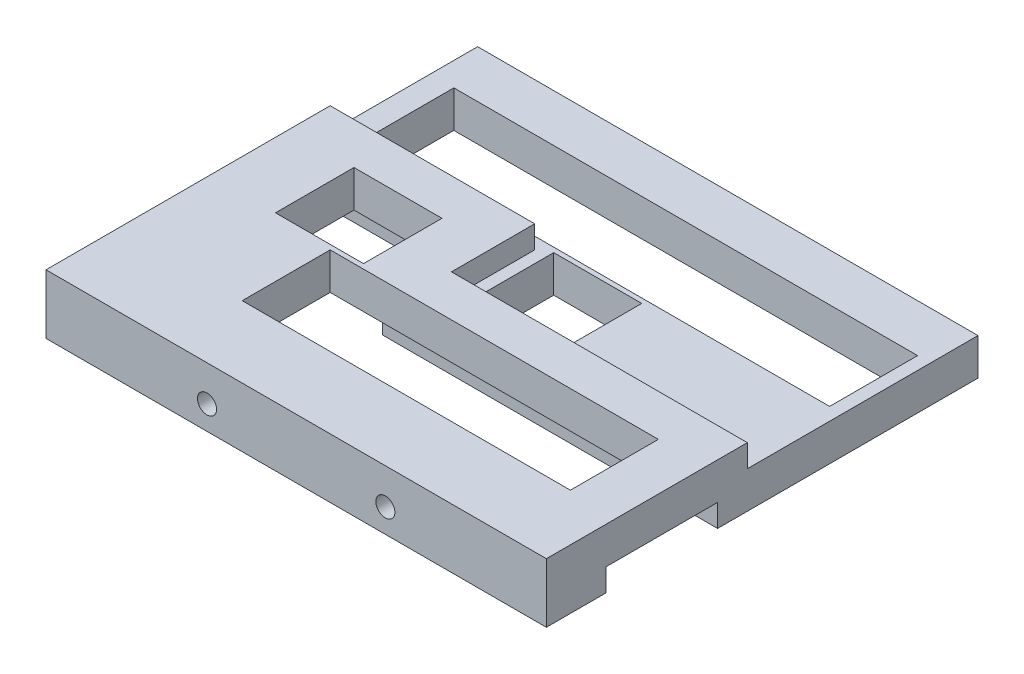
ISO-10303-21;
HEADER;
FILE_DESCRIPTION(('STEP AP214'),'2;1');
FILE_NAME('part.step','',(''),(''),'','','');
FILE_SCHEMA(('AUTOMOTIVE_DESIGN { 1 0 10303 214 1 1 1 1 }'));
ENDSEC;
DATA;
#1=APPLICATION_CONTEXT('core data for automotive mechanical design processes');
#2=APPLICATION_PROTOCOL_DEFINITION('international standard','automotive_design',2000,#1);
#3=PRODUCT_CONTEXT('',#1,'mechanical');
#4=PRODUCT('Part','Part','',(#3));
#5=PRODUCT_RELATED_PRODUCT_CATEGORY('part','',(#4));
#6=PRODUCT_DEFINITION_FORMATION('','',#4);
#7=PRODUCT_DEFINITION_CONTEXT('part definition',#1,'design');
#8=PRODUCT_DEFINITION('design','',#6,#7);
#9=PRODUCT_DEFINITION_SHAPE('','',#8);
#10=(LENGTH_UNIT() NAMED_UNIT(*) SI_UNIT(.MILLI.,.METRE.));
#11=(NAMED_UNIT(*) PLANE_ANGLE_UNIT() SI_UNIT($,.RADIAN.));
#12=(NAMED_UNIT(*) SI_UNIT($,.STERADIAN.) SOLID_ANGLE_UNIT());
#13=UNCERTAINTY_MEASURE_WITH_UNIT(LENGTH_MEASURE(1.E-05),#10,'distance_accuracy_value','');
#14=(GEOMETRIC_REPRESENTATION_CONTEXT(3) GLOBAL_UNCERTAINTY_ASSIGNED_CONTEXT((#13)) GLOBAL_UNIT_ASSIGNED_CONTEXT((#10,
#11,#12)) REPRESENTATION_CONTEXT('',''));
#15=CARTESIAN_POINT('',(0.,0.,0.));
#16=DIRECTION('',(0.,0.,1.));
#17=DIRECTION('',(1.,0.,0.));
#18=AXIS2_PLACEMENT_3D('',#15,#16,#17);
#19=CARTESIAN_POINT('',(0.,-1.2E-05,-103.));
#20=DIRECTION('',(0.,0.,-1.));
#21=DIRECTION('',(-1.,0.,0.));
#22=AXIS2_PLACEMENT_3D('',#19,#20,#21);
#23=PLANE('',#22);
#24=DIRECTION('',(-1.,0.,0.));
#25=VECTOR('',#24,1.);
#26=CARTESIAN_POINT('',(0.,9.5,-103.));
#27=LINE('',#26,#25);
#28=CARTESIAN_POINT('',(-41.4686269665969,9.5,-103.));
#29=VERTEX_POINT('',#28);
#30=CARTESIAN_POINT('',(-105.2,9.5,-103.));
#31=VERTEX_POINT('',#30);
#32=EDGE_CURVE('E263',#29,#31,#27,.T.);
#33=ORIENTED_EDGE('',*,*,#32,.F.);
#34=CARTESIAN_POINT('',(-37.5,10.,-103.));
#35=DIRECTION('',(0.,0.,-1.));
#36=DIRECTION('',(-1.,0.,0.));
#37=AXIS2_PLACEMENT_3D('',#34,#35,#36);
#38=CIRCLE('',#37,3.99999999999999);
#39=CARTESIAN_POINT('',(-33.5313730334031,9.5,-103.));
#40=VERTEX_POINT('',#39);
#41=EDGE_CURVE('E60',#29,#40,#38,.F.);
#42=ORIENTED_EDGE('',*,*,#41,.T.);
#43=CARTESIAN_POINT('',(33.5313730334031,9.5,-103.));
#44=VERTEX_POINT('',#43);
#45=EDGE_CURVE('E262',#44,#40,#27,.T.);
#46=ORIENTED_EDGE('',*,*,#45,.F.);
#47=CARTESIAN_POINT('',(37.5,10.,-103.));
#48=DIRECTION('',(0.,0.,-1.));
#49=DIRECTION('',(-1.,0.,0.));
#50=AXIS2_PLACEMENT_3D('',#47,#48,#49);
#51=CIRCLE('',#50,3.99999999999999);
#52=CARTESIAN_POINT('',(41.4686269665969,9.5,-103.));
#53=VERTEX_POINT('',#52);
#54=EDGE_CURVE('E67',#44,#53,#51,.F.);
#55=ORIENTED_EDGE('',*,*,#54,.T.);
#56=CARTESIAN_POINT('',(105.2,9.5,-103.));
#57=VERTEX_POINT('',#56);
#58=EDGE_CURVE('E282',#57,#53,#27,.T.);
#59=ORIENTED_EDGE('',*,*,#58,.F.);
#60=DIRECTION('',(0.,1.,0.));
#61=VECTOR('',#60,1.);
#62=CARTESIAN_POINT('',(105.2,-1.2E-05,-103.));
#63=LINE('',#62,#61);
#64=CARTESIAN_POINT('',(105.2,0.,-103.));
#65=VERTEX_POINT('',#64);
#66=EDGE_CURVE('E320',#65,#57,#63,.T.);
#67=ORIENTED_EDGE('',*,*,#66,.F.);
#68=DIRECTION('',(-1.,0.,0.));
#69=VECTOR('',#68,1.);
#70=CARTESIAN_POINT('',(0.,0.,-103.));
#71=LINE('',#70,#69);
#72=CARTESIAN_POINT('',(-105.2,0.,-103.));
#73=VERTEX_POINT('',#72);
#74=EDGE_CURVE('E11',#65,#73,#71,.T.);
#75=ORIENTED_EDGE('',*,*,#74,.T.);
#76=DIRECTION('',(0.,1.,0.));
#77=VECTOR('',#76,1.);
#78=CARTESIAN_POINT('',(-105.2,-1.2E-05,-103.));
#79=LINE('',#78,#77);
#80=EDGE_CURVE('E317',#73,#31,#79,.T.);
#81=ORIENTED_EDGE('',*,*,#80,.T.);
#82=EDGE_LOOP('',(#33,#42,#46,#55,#59,#67,#75,#81));
#83=FACE_BOUND('',#82,.T.);
#84=ADVANCED_FACE('F45',(#83),#23,.T.);
#85=CARTESIAN_POINT('',(105.2,25.,0.));
#86=DIRECTION('',(1.,0.,0.));
#87=DIRECTION('',(0.,0.,-1.));
#88=AXIS2_PLACEMENT_3D('',#85,#86,#87);
#89=PLANE('',#88);
#90=DIRECTION('',(0.,0.,1.));
#91=VECTOR('',#90,1.);
#92=CARTESIAN_POINT('',(105.2,0.,0.));
#93=LINE('',#92,#91);
#94=CARTESIAN_POINT('',(105.2,0.,-78.));
#95=VERTEX_POINT('',#94);
#96=EDGE_CURVE('E382',#65,#95,#93,.T.);
#97=ORIENTED_EDGE('',*,*,#96,.F.);
#98=ORIENTED_EDGE('',*,*,#66,.T.);
#99=DIRECTION('',(0.,0.,1.));
#100=VECTOR('',#99,1.);
#101=CARTESIAN_POINT('',(105.2,9.5,0.));
#102=LINE('',#101,#100);
#103=CARTESIAN_POINT('',(105.2,9.5,-150.));
#104=VERTEX_POINT('',#103);
#105=EDGE_CURVE('E287',#104,#57,#102,.T.);
#106=ORIENTED_EDGE('',*,*,#105,.F.);
#107=DIRECTION('',(0.,1.,0.));
#108=VECTOR('',#107,1.);
#109=CARTESIAN_POINT('',(105.2,-1.2E-05,-150.));
#110=LINE('',#109,#108);
#111=CARTESIAN_POINT('',(105.2,0.,-150.));
#112=VERTEX_POINT('',#111);
#113=EDGE_CURVE('E304',#112,#104,#110,.T.);
#114=ORIENTED_EDGE('',*,*,#113,.F.);
#115=CARTESIAN_POINT('',(105.2,0.,-259.5));
#116=VERTEX_POINT('',#115);
#117=EDGE_CURVE('E425',#116,#112,#93,.T.);
#118=ORIENTED_EDGE('',*,*,#117,.F.);
#119=DIRECTION('',(0.,-1.,0.));
#120=VECTOR('',#119,1.);
#121=CARTESIAN_POINT('',(105.2,25.,-259.5));
#122=LINE('',#121,#120);
#123=CARTESIAN_POINT('',(105.2,15.5,-259.5));
#124=VERTEX_POINT('',#123);
#125=EDGE_CURVE('E523',#124,#116,#122,.T.);
#126=ORIENTED_EDGE('',*,*,#125,.F.);
#127=DIRECTION('',(0.,0.,-1.));
#128=VECTOR('',#127,1.);
#129=CARTESIAN_POINT('',(105.2,15.5,0.));
#130=LINE('',#129,#128);
#131=CARTESIAN_POINT('',(105.2,15.5,-162.5));
#132=VERTEX_POINT('',#131);
#133=EDGE_CURVE('E356',#132,#124,#130,.T.);
#134=ORIENTED_EDGE('',*,*,#133,.F.);
#135=DIRECTION('',(0.,-1.,0.));
#136=VECTOR('',#135,1.);
#137=CARTESIAN_POINT('',(105.2,25.000012,-162.5));
#138=LINE('',#137,#136);
#139=CARTESIAN_POINT('',(105.2,25.,-162.5));
#140=VERTEX_POINT('',#139);
#141=EDGE_CURVE('E376',#140,#132,#138,.T.);
#142=ORIENTED_EDGE('',*,*,#141,.F.);
#143=DIRECTION('',(0.,0.,1.));
#144=VECTOR('',#143,1.);
#145=CARTESIAN_POINT('',(105.2,25.,0.));
#146=LINE('',#145,#144);
#147=CARTESIAN_POINT('',(105.2,25.,-78.));
#148=VERTEX_POINT('',#147);
#149=EDGE_CURVE('E383',#140,#148,#146,.T.);
#150=ORIENTED_EDGE('',*,*,#149,.T.);
#151=DIRECTION('',(0.,-1.,0.));
#152=VECTOR('',#151,1.);
#153=CARTESIAN_POINT('',(105.2,25.,-78.));
#154=LINE('',#153,#152);
#155=EDGE_CURVE('E424',#148,#95,#154,.T.);
#156=ORIENTED_EDGE('',*,*,#155,.T.);
#157=EDGE_LOOP('',(#97,#98,#106,#114,#118,#126,#134,#142,#150,#156));
#158=FACE_BOUND('',#157,.T.);
#159=ADVANCED_FACE('F47',(#158),#89,.T.);
#160=CARTESIAN_POINT('',(-105.2,25.,0.));
#161=DIRECTION('',(1.,0.,0.));
#162=DIRECTION('',(0.,0.,-1.));
#163=AXIS2_PLACEMENT_3D('',#160,#161,#162);
#164=PLANE('',#163);
#165=ORIENTED_EDGE('',*,*,#80,.F.);
#166=DIRECTION('',(0.,0.,1.));
#167=VECTOR('',#166,1.);
#168=CARTESIAN_POINT('',(-105.2,0.,0.));
#169=LINE('',#168,#167);
#170=CARTESIAN_POINT('',(-105.2,0.,-78.));
#171=VERTEX_POINT('',#170);
#172=EDGE_CURVE('E433',#73,#171,#169,.T.);
#173=ORIENTED_EDGE('',*,*,#172,.T.);
#174=DIRECTION('',(0.,-1.,0.));
#175=VECTOR('',#174,1.);
#176=CARTESIAN_POINT('',(-105.2,25.,-78.));
#177=LINE('',#176,#175);
#178=CARTESIAN_POINT('',(-105.2,25.,-78.));
#179=VERTEX_POINT('',#178);
#180=EDGE_CURVE('E534',#179,#171,#177,.T.);
#181=ORIENTED_EDGE('',*,*,#180,.F.);
#182=DIRECTION('',(0.,0.,1.));
#183=VECTOR('',#182,1.);
#184=CARTESIAN_POINT('',(-105.2,25.,0.));
#185=LINE('',#184,#183);
#186=CARTESIAN_POINT('',(-105.2,25.,-197.5));
#187=VERTEX_POINT('',#186);
#188=EDGE_CURVE('E386',#187,#179,#185,.T.);
#189=ORIENTED_EDGE('',*,*,#188,.F.);
#190=DIRECTION('',(0.,-1.,0.));
#191=VECTOR('',#190,1.);
#192=CARTESIAN_POINT('',(-105.2,25.000012,-197.5));
#193=LINE('',#192,#191);
#194=CARTESIAN_POINT('',(-105.2,15.5,-197.5));
#195=VERTEX_POINT('',#194);
#196=EDGE_CURVE('E372',#187,#195,#193,.T.);
#197=ORIENTED_EDGE('',*,*,#196,.T.);
#198=DIRECTION('',(0.,0.,1.));
#199=VECTOR('',#198,1.);
#200=CARTESIAN_POINT('',(-105.2,15.5,0.));
#201=LINE('',#200,#199);
#202=CARTESIAN_POINT('',(-105.2,15.5,-259.5));
#203=VERTEX_POINT('',#202);
#204=EDGE_CURVE('E362',#203,#195,#201,.T.);
#205=ORIENTED_EDGE('',*,*,#204,.F.);
#206=DIRECTION('',(0.,-1.,0.));
#207=VECTOR('',#206,1.);
#208=CARTESIAN_POINT('',(-105.2,25.,-259.5));
#209=LINE('',#208,#207);
#210=CARTESIAN_POINT('',(-105.2,0.,-259.5));
#211=VERTEX_POINT('',#210);
#212=EDGE_CURVE('E538',#203,#211,#209,.T.);
#213=ORIENTED_EDGE('',*,*,#212,.T.);
#214=CARTESIAN_POINT('',(-105.2,0.,-185.));
#215=VERTEX_POINT('',#214);
#216=EDGE_CURVE('E434',#211,#215,#169,.T.);
#217=ORIENTED_EDGE('',*,*,#216,.T.);
#218=DIRECTION('',(0.,1.,0.));
#219=VECTOR('',#218,1.);
#220=CARTESIAN_POINT('',(-105.2,-1.2E-05,-185.));
#221=LINE('',#220,#219);
#222=CARTESIAN_POINT('',(-105.2,9.5,-185.));
#223=VERTEX_POINT('',#222);
#224=EDGE_CURVE('E313',#215,#223,#221,.T.);
#225=ORIENTED_EDGE('',*,*,#224,.T.);
#226=DIRECTION('',(0.,0.,-1.));
#227=VECTOR('',#226,1.);
#228=CARTESIAN_POINT('',(-105.2,9.5,0.));
#229=LINE('',#228,#227);
#230=EDGE_CURVE('E286',#31,#223,#229,.T.);
#231=ORIENTED_EDGE('',*,*,#230,.F.);
#232=EDGE_LOOP('',(#165,#173,#181,#189,#197,#205,#213,#217,#225,#231));
#233=FACE_BOUND('',#232,.T.);
#234=ADVANCED_FACE('F645',(#233),#164,.F.);
#235=CARTESIAN_POINT('',(85.3,25.,0.));
#236=DIRECTION('',(-1.,0.,0.));
#237=DIRECTION('',(0.,0.,1.));
#238=AXIS2_PLACEMENT_3D('',#235,#236,#237);
#239=PLANE('',#238);
#240=DIRECTION('',(0.,-1.,0.));
#241=VECTOR('',#240,1.);
#242=CARTESIAN_POINT('',(85.3,25.,-145.));
#243=LINE('',#242,#241);
#244=CARTESIAN_POINT('',(85.3,25.,-145.));
#245=VERTEX_POINT('',#244);
#246=CARTESIAN_POINT('',(85.3,9.5,-145.));
#247=VERTEX_POINT('',#246);
#248=EDGE_CURVE('E473',#245,#247,#243,.T.);
#249=ORIENTED_EDGE('',*,*,#248,.T.);
#250=DIRECTION('',(0.,0.,-1.));
#251=VECTOR('',#250,1.);
#252=CARTESIAN_POINT('',(85.3,9.5,0.));
#253=LINE('',#252,#251);
#254=CARTESIAN_POINT('',(85.3,9.5,-108.));
#255=VERTEX_POINT('',#254);
#256=EDGE_CURVE('E605',#255,#247,#253,.T.);
#257=ORIENTED_EDGE('',*,*,#256,.F.);
#258=DIRECTION('',(0.,-1.,0.));
#259=VECTOR('',#258,1.);
#260=CARTESIAN_POINT('',(85.3,25.,-108.));
#261=LINE('',#260,#259);
#262=CARTESIAN_POINT('',(85.3,25.,-108.));
#263=VERTEX_POINT('',#262);
#264=EDGE_CURVE('E486',#263,#255,#261,.T.);
#265=ORIENTED_EDGE('',*,*,#264,.F.);
#266=DIRECTION('',(0.,0.,-1.));
#267=VECTOR('',#266,1.);
#268=CARTESIAN_POINT('',(85.3,25.,0.));
#269=LINE('',#268,#267);
#270=EDGE_CURVE('E409',#263,#245,#269,.T.);
#271=ORIENTED_EDGE('',*,*,#270,.T.);
#272=EDGE_LOOP('',(#249,#257,#265,#271));
#273=FACE_BOUND('',#272,.T.);
#274=ADVANCED_FACE('F782',(#273),#239,.T.);
#275=CARTESIAN_POINT('',(0.,25.,-108.));
#276=DIRECTION('',(0.,0.,-1.));
#277=DIRECTION('',(-1.,0.,0.));
#278=AXIS2_PLACEMENT_3D('',#275,#276,#277);
#279=PLANE('',#278);
#280=ORIENTED_EDGE('',*,*,#264,.T.);
#281=DIRECTION('',(1.,0.,0.));
#282=VECTOR('',#281,1.);
#283=CARTESIAN_POINT('',(0.,9.5,-108.));
#284=LINE('',#283,#282);
#285=CARTESIAN_POINT('',(-52.7,9.5,-108.));
#286=VERTEX_POINT('',#285);
#287=EDGE_CURVE('E608',#286,#255,#284,.T.);
#288=ORIENTED_EDGE('',*,*,#287,.F.);
#289=DIRECTION('',(0.,-1.,0.));
#290=VECTOR('',#289,1.);
#291=CARTESIAN_POINT('',(-52.7,25.,-108.));
#292=LINE('',#291,#290);
#293=CARTESIAN_POINT('',(-52.7,25.,-108.));
#294=VERTEX_POINT('',#293);
#295=EDGE_CURVE('E482',#294,#286,#292,.T.);
#296=ORIENTED_EDGE('',*,*,#295,.F.);
#297=DIRECTION('',(1.,0.,0.));
#298=VECTOR('',#297,1.);
#299=CARTESIAN_POINT('',(0.,25.,-108.));
#300=LINE('',#299,#298);
#301=EDGE_CURVE('E413',#294,#263,#300,.T.);
#302=ORIENTED_EDGE('',*,*,#301,.T.);
#303=EDGE_LOOP('',(#280,#288,#296,#302));
#304=FACE_BOUND('',#303,.T.);
#305=ADVANCED_FACE('F792',(#304),#279,.T.);
#306=CARTESIAN_POINT('',(-52.7,25.,0.));
#307=DIRECTION('',(-1.,0.,0.));
#308=DIRECTION('',(0.,0.,1.));
#309=AXIS2_PLACEMENT_3D('',#306,#307,#308);
#310=PLANE('',#309);
#311=DIRECTION('',(0.,0.,1.));
#312=VECTOR('',#311,1.);
#313=CARTESIAN_POINT('',(-52.7,9.5,0.));
#314=LINE('',#313,#312);
#315=CARTESIAN_POINT('',(-52.7,9.5,-145.));
#316=VERTEX_POINT('',#315);
#317=EDGE_CURVE('E599',#316,#286,#314,.T.);
#318=ORIENTED_EDGE('',*,*,#317,.F.);
#319=DIRECTION('',(0.,-1.,0.));
#320=VECTOR('',#319,1.);
#321=CARTESIAN_POINT('',(-52.7,25.,-145.));
#322=LINE('',#321,#320);
#323=CARTESIAN_POINT('',(-52.7,25.,-145.));
#324=VERTEX_POINT('',#323);
#325=EDGE_CURVE('E477',#324,#316,#322,.T.);
#326=ORIENTED_EDGE('',*,*,#325,.F.);
#327=DIRECTION('',(0.,0.,-1.));
#328=VECTOR('',#327,1.);
#329=CARTESIAN_POINT('',(-52.7,25.,0.));
#330=LINE('',#329,#328);
#331=EDGE_CURVE('E417',#294,#324,#330,.T.);
#332=ORIENTED_EDGE('',*,*,#331,.F.);
#333=ORIENTED_EDGE('',*,*,#295,.T.);
#334=EDGE_LOOP('',(#318,#326,#332,#333));
#335=FACE_BOUND('',#334,.T.);
#336=ADVANCED_FACE('F801',(#335),#310,.F.);
#337=CARTESIAN_POINT('',(-40.7,25.,0.));
#338=DIRECTION('',(-1.,0.,0.));
#339=DIRECTION('',(0.,0.,1.));
#340=AXIS2_PLACEMENT_3D('',#337,#338,#339);
#341=PLANE('',#340);
#342=DIRECTION('',(0.,-1.,0.));
#343=VECTOR('',#342,1.);
#344=CARTESIAN_POINT('',(-40.7,25.,-180.));
#345=LINE('',#344,#343);
#346=CARTESIAN_POINT('',(-40.7,25.,-180.));
#347=VERTEX_POINT('',#346);
#348=CARTESIAN_POINT('',(-40.7,9.5,-180.));
#349=VERTEX_POINT('',#348);
#350=EDGE_CURVE('E491',#347,#349,#345,.T.);
#351=ORIENTED_EDGE('',*,*,#350,.T.);
#352=DIRECTION('',(0.,0.,-1.));
#353=VECTOR('',#352,1.);
#354=CARTESIAN_POINT('',(-40.7,9.5,0.));
#355=LINE('',#354,#353);
#356=CARTESIAN_POINT('',(-40.7,9.5,-147.));
#357=VERTEX_POINT('',#356);
#358=EDGE_CURVE('E591',#357,#349,#355,.T.);
#359=ORIENTED_EDGE('',*,*,#358,.F.);
#360=DIRECTION('',(0.,-1.,0.));
#361=VECTOR('',#360,1.);
#362=CARTESIAN_POINT('',(-40.7,25.,-147.));
#363=LINE('',#362,#361);
#364=CARTESIAN_POINT('',(-40.7,25.,-147.));
#365=VERTEX_POINT('',#364);
#366=EDGE_CURVE('E478',#365,#357,#363,.T.);
#367=ORIENTED_EDGE('',*,*,#366,.F.);
#368=DIRECTION('',(0.,0.,-1.));
#369=VECTOR('',#368,1.);
#370=CARTESIAN_POINT('',(-40.7,25.,0.));
#371=LINE('',#370,#369);
#372=EDGE_CURVE('E394',#365,#347,#371,.T.);
#373=ORIENTED_EDGE('',*,*,#372,.T.);
#374=EDGE_LOOP('',(#351,#359,#367,#373));
#375=FACE_BOUND('',#374,.T.);
#376=ADVANCED_FACE('F811',(#375),#341,.T.);
#377=CARTESIAN_POINT('',(0.,25.,-147.));
#378=DIRECTION('',(0.,0.,-1.));
#379=DIRECTION('',(-1.,0.,0.));
#380=AXIS2_PLACEMENT_3D('',#377,#378,#379);
#381=PLANE('',#380);
#382=ORIENTED_EDGE('',*,*,#366,.T.);
#383=DIRECTION('',(1.,0.,0.));
#384=VECTOR('',#383,1.);
#385=CARTESIAN_POINT('',(0.,9.5,-147.));
#386=LINE('',#385,#384);
#387=CARTESIAN_POINT('',(-77.7,9.5,-147.));
#388=VERTEX_POINT('',#387);
#389=EDGE_CURVE('E596',#388,#357,#386,.T.);
#390=ORIENTED_EDGE('',*,*,#389,.F.);
#391=DIRECTION('',(0.,-1.,0.));
#392=VECTOR('',#391,1.);
#393=CARTESIAN_POINT('',(-77.7,25.,-147.));
#394=LINE('',#393,#392);
#395=CARTESIAN_POINT('',(-77.7,25.,-147.));
#396=VERTEX_POINT('',#395);
#397=EDGE_CURVE('E500',#396,#388,#394,.T.);
#398=ORIENTED_EDGE('',*,*,#397,.F.);
#399=DIRECTION('',(1.,0.,0.));
#400=VECTOR('',#399,1.);
#401=CARTESIAN_POINT('',(0.,25.,-147.));
#402=LINE('',#401,#400);
#403=EDGE_CURVE('E398',#396,#365,#402,.T.);
#404=ORIENTED_EDGE('',*,*,#403,.T.);
#405=EDGE_LOOP('',(#382,#390,#398,#404));
#406=FACE_BOUND('',#405,.T.);
#407=ADVANCED_FACE('F821',(#406),#381,.T.);
#408=CARTESIAN_POINT('',(-77.7,25.,0.));
#409=DIRECTION('',(-1.,0.,0.));
#410=DIRECTION('',(0.,0.,1.));
#411=AXIS2_PLACEMENT_3D('',#408,#409,#410);
#412=PLANE('',#411);
#413=DIRECTION('',(0.,0.,1.));
#414=VECTOR('',#413,1.);
#415=CARTESIAN_POINT('',(-77.7,9.5,0.));
#416=LINE('',#415,#414);
#417=CARTESIAN_POINT('',(-77.7,9.5,-180.));
#418=VERTEX_POINT('',#417);
#419=EDGE_CURVE('E583',#418,#388,#416,.T.);
#420=ORIENTED_EDGE('',*,*,#419,.F.);
#421=DIRECTION('',(0.,-1.,0.));
#422=VECTOR('',#421,1.);
#423=CARTESIAN_POINT('',(-77.7,25.,-180.));
#424=LINE('',#423,#422);
#425=CARTESIAN_POINT('',(-77.7,25.,-180.));
#426=VERTEX_POINT('',#425);
#427=EDGE_CURVE('E495',#426,#418,#424,.T.);
#428=ORIENTED_EDGE('',*,*,#427,.F.);
#429=DIRECTION('',(0.,0.,-1.));
#430=VECTOR('',#429,1.);
#431=CARTESIAN_POINT('',(-77.7,25.,0.));
#432=LINE('',#431,#430);
#433=EDGE_CURVE('E402',#396,#426,#432,.T.);
#434=ORIENTED_EDGE('',*,*,#433,.F.);
#435=ORIENTED_EDGE('',*,*,#397,.T.);
#436=EDGE_LOOP('',(#420,#428,#434,#435));
#437=FACE_BOUND('',#436,.T.);
#438=ADVANCED_FACE('F831',(#437),#412,.F.);
#439=CARTESIAN_POINT('',(0.,25.,-180.));
#440=DIRECTION('',(0.,0.,-1.));
#441=DIRECTION('',(-1.,0.,0.));
#442=AXIS2_PLACEMENT_3D('',#439,#440,#441);
#443=PLANE('',#442);
#444=DIRECTION('',(-1.,0.,0.));
#445=VECTOR('',#444,1.);
#446=CARTESIAN_POINT('',(0.,9.5,-180.));
#447=LINE('',#446,#445);
#448=EDGE_CURVE('E586',#349,#418,#447,.T.);
#449=ORIENTED_EDGE('',*,*,#448,.F.);
#450=ORIENTED_EDGE('',*,*,#350,.F.);
#451=DIRECTION('',(1.,0.,0.));
#452=VECTOR('',#451,1.);
#453=CARTESIAN_POINT('',(0.,25.,-180.));
#454=LINE('',#453,#452);
#455=EDGE_CURVE('E406',#426,#347,#454,.T.);
#456=ORIENTED_EDGE('',*,*,#455,.F.);
#457=ORIENTED_EDGE('',*,*,#427,.T.);
#458=EDGE_LOOP('',(#449,#450,#456,#457));
#459=FACE_BOUND('',#458,.T.);
#460=ADVANCED_FACE('F841',(#459),#443,.F.);
#461=CARTESIAN_POINT('',(0.,25.,-145.));
#462=DIRECTION('',(0.,0.,-1.));
#463=DIRECTION('',(-1.,0.,0.));
#464=AXIS2_PLACEMENT_3D('',#461,#462,#463);
#465=PLANE('',#464);
#466=DIRECTION('',(-1.,0.,0.));
#467=VECTOR('',#466,1.);
#468=CARTESIAN_POINT('',(0.,9.5,-145.));
#469=LINE('',#468,#467);
#470=EDGE_CURVE('E602',#247,#316,#469,.T.);
#471=ORIENTED_EDGE('',*,*,#470,.F.);
#472=ORIENTED_EDGE('',*,*,#248,.F.);
#473=DIRECTION('',(1.,0.,0.));
#474=VECTOR('',#473,1.);
#475=CARTESIAN_POINT('',(0.,25.,-145.));
#476=LINE('',#475,#474);
#477=EDGE_CURVE('E421',#324,#245,#476,.T.);
#478=ORIENTED_EDGE('',*,*,#477,.F.);
#479=ORIENTED_EDGE('',*,*,#325,.T.);
#480=EDGE_LOOP('',(#471,#472,#478,#479));
#481=FACE_BOUND('',#480,.T.);
#482=ADVANCED_FACE('F851',(#481),#465,.F.);
#483=CARTESIAN_POINT('',(0.,0.,0.));
#484=DIRECTION('',(0.,1.,0.));
#485=DIRECTION('',(0.,0.,1.));
#486=AXIS2_PLACEMENT_3D('',#483,#484,#485);
#487=PLANE('',#486);
#488=ORIENTED_EDGE('',*,*,#74,.F.);
#489=ORIENTED_EDGE('',*,*,#96,.T.);
#490=DIRECTION('',(1.,0.,0.));
#491=VECTOR('',#490,1.);
#492=CARTESIAN_POINT('',(0.,0.,-78.));
#493=LINE('',#492,#491);
#494=EDGE_CURVE('E438',#171,#95,#493,.T.);
#495=ORIENTED_EDGE('',*,*,#494,.F.);
#496=ORIENTED_EDGE('',*,*,#172,.F.);
#497=EDGE_LOOP('',(#488,#489,#495,#496));
#498=FACE_BOUND('',#497,.T.);
#499=ADVANCED_FACE('F636',(#498),#487,.F.);
#500=DIRECTION('',(0.,0.,-1.));
#501=VECTOR('',#500,1.);
#502=CARTESIAN_POINT('',(22.8,0.,0.));
#503=LINE('',#502,#501);
#504=CARTESIAN_POINT('',(22.8,0.,-167.5));
#505=VERTEX_POINT('',#504);
#506=CARTESIAN_POINT('',(22.8,0.,-200.5));
#507=VERTEX_POINT('',#506);
#508=EDGE_CURVE('E458',#505,#507,#503,.T.);
#509=ORIENTED_EDGE('',*,*,#508,.T.);
#510=DIRECTION('',(1.,0.,0.));
#511=VECTOR('',#510,1.);
#512=CARTESIAN_POINT('',(0.,0.,-200.5));
#513=LINE('',#512,#511);
#514=CARTESIAN_POINT('',(-14.2,0.,-200.5));
#515=VERTEX_POINT('',#514);
#516=EDGE_CURVE('E387',#515,#507,#513,.T.);
#517=ORIENTED_EDGE('',*,*,#516,.F.);
#518=DIRECTION('',(0.,0.,-1.));
#519=VECTOR('',#518,1.);
#520=CARTESIAN_POINT('',(-14.2,0.,0.));
#521=LINE('',#520,#519);
#522=CARTESIAN_POINT('',(-14.2,0.,-167.5));
#523=VERTEX_POINT('',#522);
#524=EDGE_CURVE('E466',#523,#515,#521,.T.);
#525=ORIENTED_EDGE('',*,*,#524,.F.);
#526=DIRECTION('',(1.,0.,0.));
#527=VECTOR('',#526,1.);
#528=CARTESIAN_POINT('',(-1.25650240962644E-13,0.,-167.5));
#529=LINE('',#528,#527);
#530=EDGE_CURVE('E462',#523,#505,#529,.T.);
#531=ORIENTED_EDGE('',*,*,#530,.T.);
#532=EDGE_LOOP('',(#509,#517,#525,#531));
#533=FACE_BOUND('',#532,.T.);
#534=DIRECTION('',(0.,0.,-1.));
#535=VECTOR('',#534,1.);
#536=CARTESIAN_POINT('',(99.8,0.,0.));
#537=LINE('',#536,#535);
#538=CARTESIAN_POINT('',(99.8,0.,-202.5));
#539=VERTEX_POINT('',#538);
#540=CARTESIAN_POINT('',(99.8,0.,-239.5));
#541=VERTEX_POINT('',#540);
#542=EDGE_CURVE('E442',#539,#541,#537,.T.);
#543=ORIENTED_EDGE('',*,*,#542,.T.);
#544=DIRECTION('',(1.,0.,0.));
#545=VECTOR('',#544,1.);
#546=CARTESIAN_POINT('',(0.,0.,-239.5));
#547=LINE('',#546,#545);
#548=CARTESIAN_POINT('',(-95.2,0.,-239.5));
#549=VERTEX_POINT('',#548);
#550=EDGE_CURVE('E454',#549,#541,#547,.T.);
#551=ORIENTED_EDGE('',*,*,#550,.F.);
#552=DIRECTION('',(0.,0.,-1.));
#553=VECTOR('',#552,1.);
#554=CARTESIAN_POINT('',(-95.1999999999999,0.,0.));
#555=LINE('',#554,#553);
#556=CARTESIAN_POINT('',(-95.2,0.,-202.5));
#557=VERTEX_POINT('',#556);
#558=EDGE_CURVE('E450',#557,#549,#555,.T.);
#559=ORIENTED_EDGE('',*,*,#558,.F.);
#560=DIRECTION('',(1.,0.,0.));
#561=VECTOR('',#560,1.);
#562=CARTESIAN_POINT('',(0.,0.,-202.5));
#563=LINE('',#562,#561);
#564=EDGE_CURVE('E446',#557,#539,#563,.T.);
#565=ORIENTED_EDGE('',*,*,#564,.T.);
#566=EDGE_LOOP('',(#543,#551,#559,#565));
#567=FACE_BOUND('',#566,.T.);
#568=DIRECTION('',(1.,0.,0.));
#569=VECTOR('',#568,1.);
#570=CARTESIAN_POINT('',(0.,0.,-185.));
#571=LINE('',#570,#569);
#572=CARTESIAN_POINT('',(-35.7,0.,-185.));
#573=VERTEX_POINT('',#572);
#574=EDGE_CURVE('E54',#215,#573,#571,.T.);
#575=ORIENTED_EDGE('',*,*,#574,.F.);
#576=ORIENTED_EDGE('',*,*,#216,.F.);
#577=DIRECTION('',(1.,0.,0.));
#578=VECTOR('',#577,1.);
#579=CARTESIAN_POINT('',(0.,0.,-259.5));
#580=LINE('',#579,#578);
#581=EDGE_CURVE('E429',#211,#116,#580,.T.);
#582=ORIENTED_EDGE('',*,*,#581,.T.);
#583=ORIENTED_EDGE('',*,*,#117,.T.);
#584=DIRECTION('',(1.,0.,0.));
#585=VECTOR('',#584,1.);
#586=CARTESIAN_POINT('',(0.,0.,-150.));
#587=LINE('',#586,#585);
#588=CARTESIAN_POINT('',(-35.7,0.,-150.));
#589=VERTEX_POINT('',#588);
#590=EDGE_CURVE('E554',#589,#112,#587,.T.);
#591=ORIENTED_EDGE('',*,*,#590,.F.);
#592=DIRECTION('',(0.,0.,1.));
#593=VECTOR('',#592,1.);
#594=CARTESIAN_POINT('',(-35.7,0.,0.));
#595=LINE('',#594,#593);
#596=EDGE_CURVE('E557',#573,#589,#595,.T.);
#597=ORIENTED_EDGE('',*,*,#596,.F.);
#598=EDGE_LOOP('',(#575,#576,#582,#583,#591,#597));
#599=FACE_BOUND('',#598,.T.);
#600=ADVANCED_FACE('F572',(#533,#567,#599),#487,.F.);
#601=CARTESIAN_POINT('',(22.8,25.,0.));
#602=DIRECTION('',(-1.,0.,0.));
#603=DIRECTION('',(0.,0.,1.));
#604=AXIS2_PLACEMENT_3D('',#601,#602,#603);
#605=PLANE('',#604);
#606=DIRECTION('',(0.,-1.,0.));
#607=VECTOR('',#606,1.);
#608=CARTESIAN_POINT('',(22.8,25.,-167.5));
#609=LINE('',#608,#607);
#610=CARTESIAN_POINT('',(22.8,15.5,-167.5));
#611=VERTEX_POINT('',#610);
#612=EDGE_CURVE('E496',#611,#505,#609,.T.);
#613=ORIENTED_EDGE('',*,*,#612,.F.);
#614=DIRECTION('',(0.,0.,1.));
#615=VECTOR('',#614,1.);
#616=CARTESIAN_POINT('',(22.8,15.5,0.));
#617=LINE('',#616,#615);
#618=CARTESIAN_POINT('',(22.8,15.5,-200.5));
#619=VERTEX_POINT('',#618);
#620=EDGE_CURVE('E327',#619,#611,#617,.T.);
#621=ORIENTED_EDGE('',*,*,#620,.F.);
#622=DIRECTION('',(0.,-1.,0.));
#623=VECTOR('',#622,1.);
#624=CARTESIAN_POINT('',(22.8,25.,-200.5));
#625=LINE('',#624,#623);
#626=EDGE_CURVE('E507',#619,#507,#625,.T.);
#627=ORIENTED_EDGE('',*,*,#626,.T.);
#628=ORIENTED_EDGE('',*,*,#508,.F.);
#629=EDGE_LOOP('',(#613,#621,#627,#628));
#630=FACE_BOUND('',#629,.T.);
#631=ADVANCED_FACE('F878',(#630),#605,.T.);
#632=CARTESIAN_POINT('',(-1.25650240962644E-13,25.,-167.5));
#633=DIRECTION('',(0.,0.,-1.));
#634=DIRECTION('',(-1.,0.,0.));
#635=AXIS2_PLACEMENT_3D('',#632,#633,#634);
#636=PLANE('',#635);
#637=DIRECTION('',(0.,-1.,0.));
#638=VECTOR('',#637,1.);
#639=CARTESIAN_POINT('',(-14.2,25.,-167.5));
#640=LINE('',#639,#638);
#641=CARTESIAN_POINT('',(-14.2,15.5,-167.5));
#642=VERTEX_POINT('',#641);
#643=EDGE_CURVE('E514',#642,#523,#640,.T.);
#644=ORIENTED_EDGE('',*,*,#643,.F.);
#645=DIRECTION('',(-1.,0.,0.));
#646=VECTOR('',#645,1.);
#647=CARTESIAN_POINT('',(-1.25650240962644E-13,15.5,-167.5));
#648=LINE('',#647,#646);
#649=EDGE_CURVE('E330',#611,#642,#648,.T.);
#650=ORIENTED_EDGE('',*,*,#649,.F.);
#651=ORIENTED_EDGE('',*,*,#612,.T.);
#652=ORIENTED_EDGE('',*,*,#530,.F.);
#653=EDGE_LOOP('',(#644,#650,#651,#652));
#654=FACE_BOUND('',#653,.T.);
#655=ADVANCED_FACE('F915',(#654),#636,.T.);
#656=CARTESIAN_POINT('',(-14.2,25.,0.));
#657=DIRECTION('',(-1.,0.,0.));
#658=DIRECTION('',(0.,0.,1.));
#659=AXIS2_PLACEMENT_3D('',#656,#657,#658);
#660=PLANE('',#659);
#661=DIRECTION('',(0.,0.,-1.));
#662=VECTOR('',#661,1.);
#663=CARTESIAN_POINT('',(-14.2,15.5,0.));
#664=LINE('',#663,#662);
#665=CARTESIAN_POINT('',(-14.2,15.5,-200.5));
#666=VERTEX_POINT('',#665);
#667=EDGE_CURVE('E333',#642,#666,#664,.T.);
#668=ORIENTED_EDGE('',*,*,#667,.F.);
#669=ORIENTED_EDGE('',*,*,#643,.T.);
#670=ORIENTED_EDGE('',*,*,#524,.T.);
#671=DIRECTION('',(0.,-1.,0.));
#672=VECTOR('',#671,1.);
#673=CARTESIAN_POINT('',(-14.2,25.,-200.5));
#674=LINE('',#673,#672);
#675=EDGE_CURVE('E510',#666,#515,#674,.T.);
#676=ORIENTED_EDGE('',*,*,#675,.F.);
#677=EDGE_LOOP('',(#668,#669,#670,#676));
#678=FACE_BOUND('',#677,.T.);
#679=ADVANCED_FACE('F925',(#678),#660,.F.);
#680=CARTESIAN_POINT('',(99.8,25.,0.));
#681=DIRECTION('',(-1.,0.,0.));
#682=DIRECTION('',(0.,0.,1.));
#683=AXIS2_PLACEMENT_3D('',#680,#681,#682);
#684=PLANE('',#683);
#685=DIRECTION('',(0.,-1.,0.));
#686=VECTOR('',#685,1.);
#687=CARTESIAN_POINT('',(99.8,25.,-202.5));
#688=LINE('',#687,#686);
#689=CARTESIAN_POINT('',(99.8,15.5,-202.5));
#690=VERTEX_POINT('',#689);
#691=EDGE_CURVE('E511',#690,#539,#688,.T.);
#692=ORIENTED_EDGE('',*,*,#691,.F.);
#693=DIRECTION('',(0.,0.,1.));
#694=VECTOR('',#693,1.);
#695=CARTESIAN_POINT('',(99.8,15.5,0.));
#696=LINE('',#695,#694);
#697=CARTESIAN_POINT('',(99.8,15.5,-239.5));
#698=VERTEX_POINT('',#697);
#699=EDGE_CURVE('E339',#698,#690,#696,.T.);
#700=ORIENTED_EDGE('',*,*,#699,.F.);
#701=DIRECTION('',(0.,-1.,0.));
#702=VECTOR('',#701,1.);
#703=CARTESIAN_POINT('',(99.8,25.,-239.5));
#704=LINE('',#703,#702);
#705=EDGE_CURVE('E519',#698,#541,#704,.T.);
#706=ORIENTED_EDGE('',*,*,#705,.T.);
#707=ORIENTED_EDGE('',*,*,#542,.F.);
#708=EDGE_LOOP('',(#692,#700,#706,#707));
#709=FACE_BOUND('',#708,.T.);
#710=ADVANCED_FACE('F935',(#709),#684,.T.);
#711=CARTESIAN_POINT('',(0.,25.,-202.5));
#712=DIRECTION('',(0.,0.,-1.));
#713=DIRECTION('',(-1.,0.,0.));
#714=AXIS2_PLACEMENT_3D('',#711,#712,#713);
#715=PLANE('',#714);
#716=DIRECTION('',(0.,-1.,0.));
#717=VECTOR('',#716,1.);
#718=CARTESIAN_POINT('',(-95.2,25.,-202.5));
#719=LINE('',#718,#717);
#720=CARTESIAN_POINT('',(-95.2,15.5,-202.5));
#721=VERTEX_POINT('',#720);
#722=EDGE_CURVE('E526',#721,#557,#719,.T.);
#723=ORIENTED_EDGE('',*,*,#722,.F.);
#724=DIRECTION('',(-1.,0.,0.));
#725=VECTOR('',#724,1.);
#726=CARTESIAN_POINT('',(0.,15.5,-202.5));
#727=LINE('',#726,#725);
#728=EDGE_CURVE('E342',#690,#721,#727,.T.);
#729=ORIENTED_EDGE('',*,*,#728,.F.);
#730=ORIENTED_EDGE('',*,*,#691,.T.);
#731=ORIENTED_EDGE('',*,*,#564,.F.);
#732=EDGE_LOOP('',(#723,#729,#730,#731));
#733=FACE_BOUND('',#732,.T.);
#734=ADVANCED_FACE('F945',(#733),#715,.T.);
#735=CARTESIAN_POINT('',(-95.1999999999999,25.,0.));
#736=DIRECTION('',(-1.,0.,0.));
#737=DIRECTION('',(0.,0.,1.));
#738=AXIS2_PLACEMENT_3D('',#735,#736,#737);
#739=PLANE('',#738);
#740=DIRECTION('',(0.,0.,-1.));
#741=VECTOR('',#740,1.);
#742=CARTESIAN_POINT('',(-95.1999999999999,15.5,0.));
#743=LINE('',#742,#741);
#744=CARTESIAN_POINT('',(-95.2,15.5,-239.5));
#745=VERTEX_POINT('',#744);
#746=EDGE_CURVE('E345',#721,#745,#743,.T.);
#747=ORIENTED_EDGE('',*,*,#746,.F.);
#748=ORIENTED_EDGE('',*,*,#722,.T.);
#749=ORIENTED_EDGE('',*,*,#558,.T.);
#750=DIRECTION('',(0.,-1.,0.));
#751=VECTOR('',#750,1.);
#752=CARTESIAN_POINT('',(-95.2,25.,-239.5));
#753=LINE('',#752,#751);
#754=EDGE_CURVE('E522',#745,#549,#753,.T.);
#755=ORIENTED_EDGE('',*,*,#754,.F.);
#756=EDGE_LOOP('',(#747,#748,#749,#755));
#757=FACE_BOUND('',#756,.T.);
#758=ADVANCED_FACE('F955',(#757),#739,.F.);
#759=CARTESIAN_POINT('',(0.,25.,-259.5));
#760=DIRECTION('',(0.,0.,-1.));
#761=DIRECTION('',(-1.,0.,0.));
#762=AXIS2_PLACEMENT_3D('',#759,#760,#761);
#763=PLANE('',#762);
#764=ORIENTED_EDGE('',*,*,#212,.F.);
#765=DIRECTION('',(-1.,0.,0.));
#766=VECTOR('',#765,1.);
#767=CARTESIAN_POINT('',(0.,15.5,-259.5));
#768=LINE('',#767,#766);
#769=EDGE_CURVE('E359',#124,#203,#768,.T.);
#770=ORIENTED_EDGE('',*,*,#769,.F.);
#771=ORIENTED_EDGE('',*,*,#125,.T.);
#772=ORIENTED_EDGE('',*,*,#581,.F.);
#773=EDGE_LOOP('',(#764,#770,#771,#772));
#774=FACE_BOUND('',#773,.T.);
#775=ADVANCED_FACE('F652',(#774),#763,.T.);
#776=CARTESIAN_POINT('',(0.,25.,-200.5));
#777=DIRECTION('',(0.,0.,-1.));
#778=DIRECTION('',(-1.,0.,0.));
#779=AXIS2_PLACEMENT_3D('',#776,#777,#778);
#780=PLANE('',#779);
#781=DIRECTION('',(1.,0.,0.));
#782=VECTOR('',#781,1.);
#783=CARTESIAN_POINT('',(0.,15.5,-200.5));
#784=LINE('',#783,#782);
#785=EDGE_CURVE('E324',#666,#619,#784,.T.);
#786=ORIENTED_EDGE('',*,*,#785,.F.);
#787=ORIENTED_EDGE('',*,*,#675,.T.);
#788=ORIENTED_EDGE('',*,*,#516,.T.);
#789=ORIENTED_EDGE('',*,*,#626,.F.);
#790=EDGE_LOOP('',(#786,#787,#788,#789));
#791=FACE_BOUND('',#790,.T.);
#792=ADVANCED_FACE('F974',(#791),#780,.F.);
#793=CARTESIAN_POINT('',(0.,25.,-239.5));
#794=DIRECTION('',(0.,0.,-1.));
#795=DIRECTION('',(-1.,0.,0.));
#796=AXIS2_PLACEMENT_3D('',#793,#794,#795);
#797=PLANE('',#796);
#798=DIRECTION('',(1.,0.,0.));
#799=VECTOR('',#798,1.);
#800=CARTESIAN_POINT('',(0.,15.5,-239.5));
#801=LINE('',#800,#799);
#802=EDGE_CURVE('E336',#745,#698,#801,.T.);
#803=ORIENTED_EDGE('',*,*,#802,.F.);
#804=ORIENTED_EDGE('',*,*,#754,.T.);
#805=ORIENTED_EDGE('',*,*,#550,.T.);
#806=ORIENTED_EDGE('',*,*,#705,.F.);
#807=EDGE_LOOP('',(#803,#804,#805,#806));
#808=FACE_BOUND('',#807,.T.);
#809=ADVANCED_FACE('F982',(#808),#797,.F.);
#810=CARTESIAN_POINT('',(0.,25.,0.));
#811=DIRECTION('',(0.,1.,0.));
#812=DIRECTION('',(0.,0.,1.));
#813=AXIS2_PLACEMENT_3D('',#810,#811,#812);
#814=PLANE('',#813);
#815=ORIENTED_EDGE('',*,*,#270,.F.);
#816=ORIENTED_EDGE('',*,*,#301,.F.);
#817=ORIENTED_EDGE('',*,*,#331,.T.);
#818=ORIENTED_EDGE('',*,*,#477,.T.);
#819=EDGE_LOOP('',(#815,#816,#817,#818));
#820=FACE_BOUND('',#819,.T.);
#821=ORIENTED_EDGE('',*,*,#372,.F.);
#822=ORIENTED_EDGE('',*,*,#403,.F.);
#823=ORIENTED_EDGE('',*,*,#433,.T.);
#824=ORIENTED_EDGE('',*,*,#455,.T.);
#825=EDGE_LOOP('',(#821,#822,#823,#824));
#826=FACE_BOUND('',#825,.T.);
#827=ORIENTED_EDGE('',*,*,#149,.F.);
#828=DIRECTION('',(-1.,0.,0.));
#829=VECTOR('',#828,1.);
#830=CARTESIAN_POINT('',(0.,25.,-162.5));
#831=LINE('',#830,#829);
#832=CARTESIAN_POINT('',(-19.2,25.,-162.5));
#833=VERTEX_POINT('',#832);
#834=EDGE_CURVE('E550',#140,#833,#831,.T.);
#835=ORIENTED_EDGE('',*,*,#834,.T.);
#836=DIRECTION('',(0.,0.,-1.));
#837=VECTOR('',#836,1.);
#838=CARTESIAN_POINT('',(-19.2,25.,0.));
#839=LINE('',#838,#837);
#840=CARTESIAN_POINT('',(-19.2,25.,-197.5));
#841=VERTEX_POINT('',#840);
#842=EDGE_CURVE('E546',#833,#841,#839,.T.);
#843=ORIENTED_EDGE('',*,*,#842,.T.);
#844=DIRECTION('',(-1.,0.,0.));
#845=VECTOR('',#844,1.);
#846=CARTESIAN_POINT('',(0.,25.,-197.5));
#847=LINE('',#846,#845);
#848=EDGE_CURVE('E490',#841,#187,#847,.T.);
#849=ORIENTED_EDGE('',*,*,#848,.T.);
#850=ORIENTED_EDGE('',*,*,#188,.T.);
#851=DIRECTION('',(1.,0.,0.));
#852=VECTOR('',#851,1.);
#853=CARTESIAN_POINT('',(0.,25.,-78.));
#854=LINE('',#853,#852);
#855=EDGE_CURVE('E390',#179,#148,#854,.T.);
#856=ORIENTED_EDGE('',*,*,#855,.T.);
#857=EDGE_LOOP('',(#827,#835,#843,#849,#850,#856));
#858=FACE_BOUND('',#857,.T.);
#859=ADVANCED_FACE('F625',(#820,#826,#858),#814,.T.);
#860=CARTESIAN_POINT('',(0.,25.,-78.));
#861=DIRECTION('',(0.,0.,-1.));
#862=DIRECTION('',(-1.,0.,0.));
#863=AXIS2_PLACEMENT_3D('',#860,#861,#862);
#864=PLANE('',#863);
#865=CARTESIAN_POINT('',(-37.5,10.,-78.));
#866=DIRECTION('',(0.,0.,1.));
#867=DIRECTION('',(1.,0.,0.));
#868=AXIS2_PLACEMENT_3D('',#865,#866,#867);
#869=CIRCLE('',#868,3.99999999999999);
#870=CARTESIAN_POINT('',(-33.5,10.,-78.));
#871=VERTEX_POINT('',#870);
#872=EDGE_CURVE('E268',#871,#871,#869,.T.);
#873=ORIENTED_EDGE('',*,*,#872,.F.);
#874=EDGE_LOOP('',(#873));
#875=FACE_BOUND('',#874,.T.);
#876=CARTESIAN_POINT('',(37.5,10.,-78.));
#877=DIRECTION('',(0.,0.,1.));
#878=DIRECTION('',(1.,0.,0.));
#879=AXIS2_PLACEMENT_3D('',#876,#877,#878);
#880=CIRCLE('',#879,3.99999999999999);
#881=CARTESIAN_POINT('',(41.5,10.,-78.));
#882=VERTEX_POINT('',#881);
#883=EDGE_CURVE('E275',#882,#882,#880,.T.);
#884=ORIENTED_EDGE('',*,*,#883,.F.);
#885=EDGE_LOOP('',(#884));
#886=FACE_BOUND('',#885,.T.);
#887=ORIENTED_EDGE('',*,*,#494,.T.);
#888=ORIENTED_EDGE('',*,*,#155,.F.);
#889=ORIENTED_EDGE('',*,*,#855,.F.);
#890=ORIENTED_EDGE('',*,*,#180,.T.);
#891=EDGE_LOOP('',(#887,#888,#889,#890));
#892=FACE_BOUND('',#891,.T.);
#893=ADVANCED_FACE('F621',(#875,#886,#892),#864,.F.);
#894=CARTESIAN_POINT('',(-19.2,25.000012,0.));
#895=DIRECTION('',(1.,0.,0.));
#896=DIRECTION('',(0.,0.,-1.));
#897=AXIS2_PLACEMENT_3D('',#894,#895,#896);
#898=PLANE('',#897);
#899=DIRECTION('',(0.,-1.,0.));
#900=VECTOR('',#899,1.);
#901=CARTESIAN_POINT('',(-19.2,25.000012,-162.5));
#902=LINE('',#901,#900);
#903=CARTESIAN_POINT('',(-19.2,15.5,-162.5));
#904=VERTEX_POINT('',#903);
#905=EDGE_CURVE('E379',#833,#904,#902,.T.);
#906=ORIENTED_EDGE('',*,*,#905,.T.);
#907=DIRECTION('',(0.,0.,1.));
#908=VECTOR('',#907,1.);
#909=CARTESIAN_POINT('',(-19.2,15.5,0.));
#910=LINE('',#909,#908);
#911=CARTESIAN_POINT('',(-19.2,15.5,-197.5));
#912=VERTEX_POINT('',#911);
#913=EDGE_CURVE('E348',#912,#904,#910,.T.);
#914=ORIENTED_EDGE('',*,*,#913,.F.);
#915=DIRECTION('',(0.,-1.,0.));
#916=VECTOR('',#915,1.);
#917=CARTESIAN_POINT('',(-19.2,25.000012,-197.5));
#918=LINE('',#917,#916);
#919=EDGE_CURVE('E369',#841,#912,#918,.T.);
#920=ORIENTED_EDGE('',*,*,#919,.F.);
#921=ORIENTED_EDGE('',*,*,#842,.F.);
#922=EDGE_LOOP('',(#906,#914,#920,#921));
#923=FACE_BOUND('',#922,.T.);
#924=ADVANCED_FACE('F624',(#923),#898,.T.);
#925=CARTESIAN_POINT('',(0.,25.000012,-162.5));
#926=DIRECTION('',(0.,0.,-1.));
#927=DIRECTION('',(-1.,0.,0.));
#928=AXIS2_PLACEMENT_3D('',#925,#926,#927);
#929=PLANE('',#928);
#930=ORIENTED_EDGE('',*,*,#141,.T.);
#931=DIRECTION('',(1.,0.,0.));
#932=VECTOR('',#931,1.);
#933=CARTESIAN_POINT('',(0.,15.5,-162.5));
#934=LINE('',#933,#932);
#935=EDGE_CURVE('E352',#904,#132,#934,.T.);
#936=ORIENTED_EDGE('',*,*,#935,.F.);
#937=ORIENTED_EDGE('',*,*,#905,.F.);
#938=ORIENTED_EDGE('',*,*,#834,.F.);
#939=EDGE_LOOP('',(#930,#936,#937,#938));
#940=FACE_BOUND('',#939,.T.);
#941=ADVANCED_FACE('F660',(#940),#929,.T.);
#942=CARTESIAN_POINT('',(0.,25.000012,-197.5));
#943=DIRECTION('',(0.,0.,-1.));
#944=DIRECTION('',(-1.,0.,0.));
#945=AXIS2_PLACEMENT_3D('',#942,#943,#944);
#946=PLANE('',#945);
#947=ORIENTED_EDGE('',*,*,#919,.T.);
#948=DIRECTION('',(1.,0.,0.));
#949=VECTOR('',#948,1.);
#950=CARTESIAN_POINT('',(0.,15.5,-197.5));
#951=LINE('',#950,#949);
#952=EDGE_CURVE('E365',#195,#912,#951,.T.);
#953=ORIENTED_EDGE('',*,*,#952,.F.);
#954=ORIENTED_EDGE('',*,*,#196,.F.);
#955=ORIENTED_EDGE('',*,*,#848,.F.);
#956=EDGE_LOOP('',(#947,#953,#954,#955));
#957=FACE_BOUND('',#956,.T.);
#958=ADVANCED_FACE('F665',(#957),#946,.T.);
#959=CARTESIAN_POINT('',(0.,15.5,0.));
#960=DIRECTION('',(0.,1.,0.));
#961=DIRECTION('',(0.,0.,1.));
#962=AXIS2_PLACEMENT_3D('',#959,#960,#961);
#963=PLANE('',#962);
#964=ORIENTED_EDGE('',*,*,#785,.T.);
#965=ORIENTED_EDGE('',*,*,#620,.T.);
#966=ORIENTED_EDGE('',*,*,#649,.T.);
#967=ORIENTED_EDGE('',*,*,#667,.T.);
#968=EDGE_LOOP('',(#964,#965,#966,#967));
#969=FACE_BOUND('',#968,.T.);
#970=ORIENTED_EDGE('',*,*,#802,.T.);
#971=ORIENTED_EDGE('',*,*,#699,.T.);
#972=ORIENTED_EDGE('',*,*,#728,.T.);
#973=ORIENTED_EDGE('',*,*,#746,.T.);
#974=EDGE_LOOP('',(#970,#971,#972,#973));
#975=FACE_BOUND('',#974,.T.);
#976=ORIENTED_EDGE('',*,*,#913,.T.);
#977=ORIENTED_EDGE('',*,*,#935,.T.);
#978=ORIENTED_EDGE('',*,*,#133,.T.);
#979=ORIENTED_EDGE('',*,*,#769,.T.);
#980=ORIENTED_EDGE('',*,*,#204,.T.);
#981=ORIENTED_EDGE('',*,*,#952,.T.);
#982=EDGE_LOOP('',(#976,#977,#978,#979,#980,#981));
#983=FACE_BOUND('',#982,.T.);
#984=ADVANCED_FACE('F655',(#969,#975,#983),#963,.T.);
#985=CARTESIAN_POINT('',(0.,-1.2E-05,-185.));
#986=DIRECTION('',(0.,0.,1.));
#987=DIRECTION('',(1.,0.,0.));
#988=AXIS2_PLACEMENT_3D('',#985,#986,#987);
#989=PLANE('',#988);
#990=ORIENTED_EDGE('',*,*,#574,.T.);
#991=DIRECTION('',(0.,1.,0.));
#992=VECTOR('',#991,1.);
#993=CARTESIAN_POINT('',(-35.7,-1.2E-05,-185.));
#994=LINE('',#993,#992);
#995=CARTESIAN_POINT('',(-35.7,9.5,-185.));
#996=VERTEX_POINT('',#995);
#997=EDGE_CURVE('E310',#573,#996,#994,.T.);
#998=ORIENTED_EDGE('',*,*,#997,.T.);
#999=DIRECTION('',(1.,0.,0.));
#1000=VECTOR('',#999,1.);
#1001=CARTESIAN_POINT('',(0.,9.5,-185.));
#1002=LINE('',#1001,#1000);
#1003=EDGE_CURVE('E292',#223,#996,#1002,.T.);
#1004=ORIENTED_EDGE('',*,*,#1003,.F.);
#1005=ORIENTED_EDGE('',*,*,#224,.F.);
#1006=EDGE_LOOP('',(#990,#998,#1004,#1005));
#1007=FACE_BOUND('',#1006,.T.);
#1008=ADVANCED_FACE('F564',(#1007),#989,.T.);
#1009=CARTESIAN_POINT('',(-35.7,-1.2E-05,0.));
#1010=DIRECTION('',(-1.,0.,0.));
#1011=DIRECTION('',(0.,0.,1.));
#1012=AXIS2_PLACEMENT_3D('',#1009,#1010,#1011);
#1013=PLANE('',#1012);
#1014=ORIENTED_EDGE('',*,*,#596,.T.);
#1015=DIRECTION('',(0.,1.,0.));
#1016=VECTOR('',#1015,1.);
#1017=CARTESIAN_POINT('',(-35.7,-1.2E-05,-150.));
#1018=LINE('',#1017,#1016);
#1019=CARTESIAN_POINT('',(-35.7,9.5,-150.));
#1020=VERTEX_POINT('',#1019);
#1021=EDGE_CURVE('E307',#589,#1020,#1018,.T.);
#1022=ORIENTED_EDGE('',*,*,#1021,.T.);
#1023=DIRECTION('',(0.,0.,1.));
#1024=VECTOR('',#1023,1.);
#1025=CARTESIAN_POINT('',(-35.7,9.5,0.));
#1026=LINE('',#1025,#1024);
#1027=EDGE_CURVE('E296',#996,#1020,#1026,.T.);
#1028=ORIENTED_EDGE('',*,*,#1027,.F.);
#1029=ORIENTED_EDGE('',*,*,#997,.F.);
#1030=EDGE_LOOP('',(#1014,#1022,#1028,#1029));
#1031=FACE_BOUND('',#1030,.T.);
#1032=ADVANCED_FACE('F570',(#1031),#1013,.T.);
#1033=CARTESIAN_POINT('',(0.,-1.2E-05,-150.));
#1034=DIRECTION('',(0.,0.,1.));
#1035=DIRECTION('',(1.,0.,0.));
#1036=AXIS2_PLACEMENT_3D('',#1033,#1034,#1035);
#1037=PLANE('',#1036);
#1038=ORIENTED_EDGE('',*,*,#590,.T.);
#1039=ORIENTED_EDGE('',*,*,#113,.T.);
#1040=DIRECTION('',(1.,0.,0.));
#1041=VECTOR('',#1040,1.);
#1042=CARTESIAN_POINT('',(0.,9.5,-150.));
#1043=LINE('',#1042,#1041);
#1044=EDGE_CURVE('E300',#1020,#104,#1043,.T.);
#1045=ORIENTED_EDGE('',*,*,#1044,.F.);
#1046=ORIENTED_EDGE('',*,*,#1021,.F.);
#1047=EDGE_LOOP('',(#1038,#1039,#1045,#1046));
#1048=FACE_BOUND('',#1047,.T.);
#1049=ADVANCED_FACE('F576',(#1048),#1037,.T.);
#1050=CARTESIAN_POINT('',(0.,9.5,0.));
#1051=DIRECTION('',(0.,-1.,0.));
#1052=DIRECTION('',(0.,0.,-1.));
#1053=AXIS2_PLACEMENT_3D('',#1050,#1051,#1052);
#1054=PLANE('',#1053);
#1055=ORIENTED_EDGE('',*,*,#287,.T.);
#1056=ORIENTED_EDGE('',*,*,#256,.T.);
#1057=ORIENTED_EDGE('',*,*,#470,.T.);
#1058=ORIENTED_EDGE('',*,*,#317,.T.);
#1059=EDGE_LOOP('',(#1055,#1056,#1057,#1058));
#1060=FACE_BOUND('',#1059,.T.);
#1061=ORIENTED_EDGE('',*,*,#389,.T.);
#1062=ORIENTED_EDGE('',*,*,#358,.T.);
#1063=ORIENTED_EDGE('',*,*,#448,.T.);
#1064=ORIENTED_EDGE('',*,*,#419,.T.);
#1065=EDGE_LOOP('',(#1061,#1062,#1063,#1064));
#1066=FACE_BOUND('',#1065,.T.);
#1067=ORIENTED_EDGE('',*,*,#105,.T.);
#1068=ORIENTED_EDGE('',*,*,#58,.T.);
#1069=EDGE_CURVE('E279',#53,#44,#27,.T.);
#1070=ORIENTED_EDGE('',*,*,#1069,.T.);
#1071=ORIENTED_EDGE('',*,*,#45,.T.);
#1072=EDGE_CURVE('E255',#40,#29,#27,.T.);
#1073=ORIENTED_EDGE('',*,*,#1072,.T.);
#1074=ORIENTED_EDGE('',*,*,#32,.T.);
#1075=ORIENTED_EDGE('',*,*,#230,.T.);
#1076=ORIENTED_EDGE('',*,*,#1003,.T.);
#1077=ORIENTED_EDGE('',*,*,#1027,.T.);
#1078=ORIENTED_EDGE('',*,*,#1044,.T.);
#1079=EDGE_LOOP('',(#1067,#1068,#1070,#1071,#1073,#1074,#1075,#1076,#1077,#1078));
#1080=FACE_BOUND('',#1079,.T.);
#1081=ADVANCED_FACE('F277',(#1060,#1066,#1080),#1054,.T.);
#1082=CARTESIAN_POINT('',(37.5,10.,-78.));
#1083=DIRECTION('',(0.,0.,1.));
#1084=DIRECTION('',(1.,0.,0.));
#1085=AXIS2_PLACEMENT_3D('',#1082,#1083,#1084);
#1086=CYLINDRICAL_SURFACE('',#1085,3.99999999999999);
#1087=ORIENTED_EDGE('',*,*,#54,.F.);
#1088=EDGE_CURVE('E613',#53,#44,#51,.F.);
#1089=ORIENTED_EDGE('',*,*,#1088,.F.);
#1090=EDGE_LOOP('',(#1087,#1089));
#1091=FACE_BOUND('',#1090,.T.);
#1092=ORIENTED_EDGE('',*,*,#883,.T.);
#1093=EDGE_LOOP('',(#1092));
#1094=FACE_BOUND('',#1093,.T.);
#1095=ADVANCED_FACE('F689',(#1091,#1094),#1086,.F.);
#1096=CARTESIAN_POINT('',(0.,-1.2E-05,-103.));
#1097=DIRECTION('',(0.,0.,-1.));
#1098=DIRECTION('',(-1.,0.,0.));
#1099=AXIS2_PLACEMENT_3D('',#1096,#1097,#1098);
#1100=PLANE('',#1099);
#1101=ORIENTED_EDGE('',*,*,#1069,.F.);
#1102=ORIENTED_EDGE('',*,*,#1088,.T.);
#1103=EDGE_LOOP('',(#1101,#1102));
#1104=FACE_BOUND('',#1103,.T.);
#1105=ADVANCED_FACE('F691',(#1104),#1100,.F.);
#1106=CARTESIAN_POINT('',(-37.5,10.,-78.));
#1107=DIRECTION('',(0.,0.,1.));
#1108=DIRECTION('',(1.,0.,0.));
#1109=AXIS2_PLACEMENT_3D('',#1106,#1107,#1108);
#1110=CYLINDRICAL_SURFACE('',#1109,3.99999999999999);
#1111=ORIENTED_EDGE('',*,*,#41,.F.);
#1112=EDGE_CURVE('E257',#40,#29,#38,.F.);
#1113=ORIENTED_EDGE('',*,*,#1112,.F.);
#1114=EDGE_LOOP('',(#1111,#1113));
#1115=FACE_BOUND('',#1114,.T.);
#1116=ORIENTED_EDGE('',*,*,#872,.T.);
#1117=EDGE_LOOP('',(#1116));
#1118=FACE_BOUND('',#1117,.T.);
#1119=ADVANCED_FACE('F265',(#1115,#1118),#1110,.F.);
#1120=CARTESIAN_POINT('',(0.,-1.2E-05,-103.));
#1121=DIRECTION('',(0.,0.,-1.));
#1122=DIRECTION('',(-1.,0.,0.));
#1123=AXIS2_PLACEMENT_3D('',#1120,#1121,#1122);
#1124=PLANE('',#1123);
#1125=ORIENTED_EDGE('',*,*,#1072,.F.);
#1126=ORIENTED_EDGE('',*,*,#1112,.T.);
#1127=EDGE_LOOP('',(#1125,#1126));
#1128=FACE_BOUND('',#1127,.T.);
#1129=ADVANCED_FACE('F256',(#1128),#1124,.F.);
#1130=CLOSED_SHELL('',(#84,#159,#234,#274,#305,#336,#376,#407,#438,#460,#482,#499,#600,#631,
#655,#679,#710,#734,#758,#775,#792,#809,#859,#893,#924,#941,#958,#984,#1008,#1032,#1049,#1081,
#1095,#1105,#1119,#1129));
#1131=MANIFOLD_SOLID_BREP('B2',#1130);
#1132=ADVANCED_BREP_SHAPE_REPRESENTATION('',(#18,#1131),#14);
#1133=SHAPE_DEFINITION_REPRESENTATION(#9,#1132);
ENDSEC;
END-ISO-10303-21;
